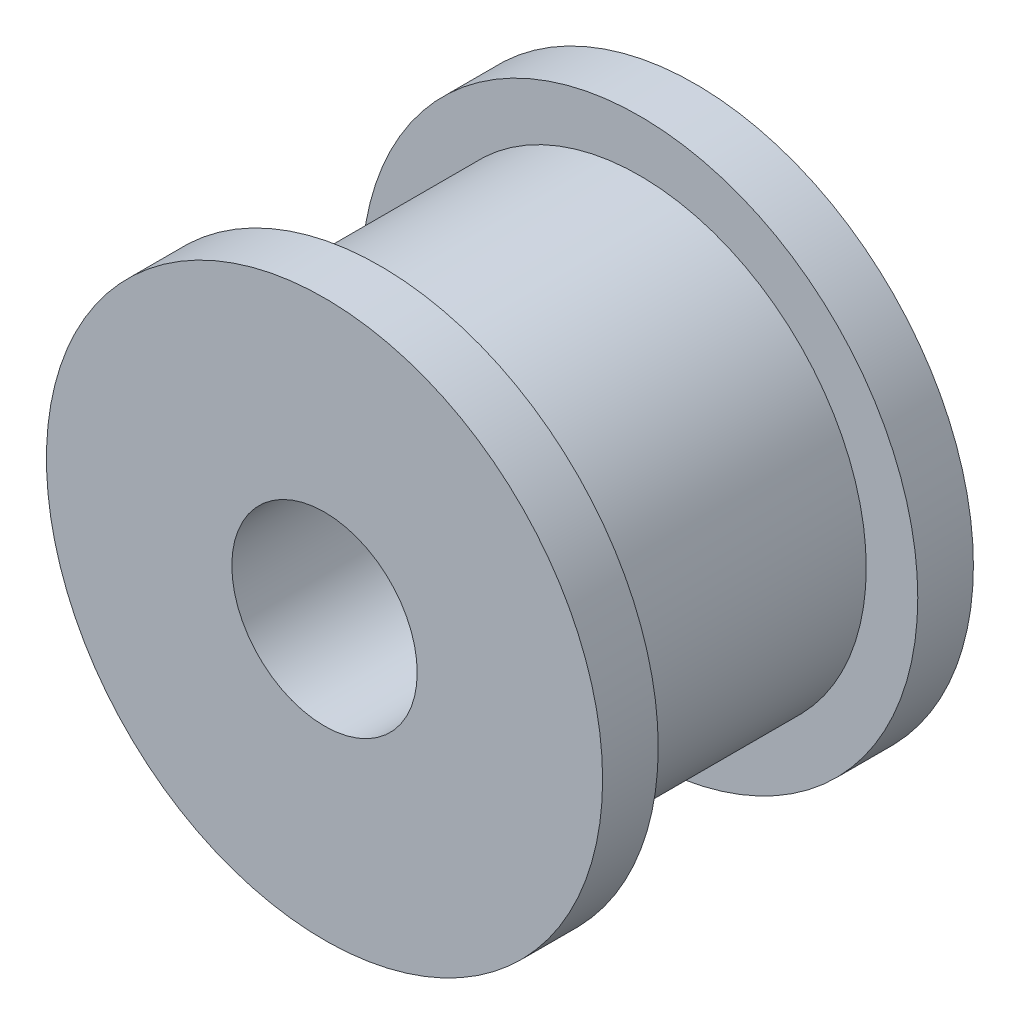
ISO-10303-21;
HEADER;
FILE_DESCRIPTION(('STEP AP214'),'2;1');
FILE_NAME('part.step','',(''),(''),'','','');
FILE_SCHEMA(('AUTOMOTIVE_DESIGN { 1 0 10303 214 1 1 1 1 }'));
ENDSEC;
DATA;
#1=APPLICATION_CONTEXT('core data for automotive mechanical design processes');
#2=APPLICATION_PROTOCOL_DEFINITION('international standard','automotive_design',2000,#1);
#3=PRODUCT_CONTEXT('',#1,'mechanical');
#4=PRODUCT('Part','Part','',(#3));
#5=PRODUCT_RELATED_PRODUCT_CATEGORY('part','',(#4));
#6=PRODUCT_DEFINITION_FORMATION('','',#4);
#7=PRODUCT_DEFINITION_CONTEXT('part definition',#1,'design');
#8=PRODUCT_DEFINITION('design','',#6,#7);
#9=PRODUCT_DEFINITION_SHAPE('','',#8);
#10=(LENGTH_UNIT() NAMED_UNIT(*) SI_UNIT(.MILLI.,.METRE.));
#11=(NAMED_UNIT(*) PLANE_ANGLE_UNIT() SI_UNIT($,.RADIAN.));
#12=(NAMED_UNIT(*) SI_UNIT($,.STERADIAN.) SOLID_ANGLE_UNIT());
#13=UNCERTAINTY_MEASURE_WITH_UNIT(LENGTH_MEASURE(1.E-05),#10,'distance_accuracy_value','');
#14=(GEOMETRIC_REPRESENTATION_CONTEXT(3) GLOBAL_UNCERTAINTY_ASSIGNED_CONTEXT((#13)) GLOBAL_UNIT_ASSIGNED_CONTEXT((#10,
#11,#12)) REPRESENTATION_CONTEXT('',''));
#15=CARTESIAN_POINT('',(0.,0.,0.));
#16=DIRECTION('',(0.,0.,1.));
#17=DIRECTION('',(1.,0.,0.));
#18=AXIS2_PLACEMENT_3D('',#15,#16,#17);
#19=CARTESIAN_POINT('',(0.,0.,-10.));
#20=DIRECTION('',(0.,0.,-1.));
#21=DIRECTION('',(-1.,0.,0.));
#22=AXIS2_PLACEMENT_3D('',#19,#20,#21);
#23=PLANE('',#22);
#24=CARTESIAN_POINT('',(0.,0.,-10.));
#25=DIRECTION('',(0.,0.,-1.));
#26=DIRECTION('',(-1.,0.,0.));
#27=AXIS2_PLACEMENT_3D('',#24,#25,#26);
#28=CIRCLE('',#27,2.49999999999999);
#29=CARTESIAN_POINT('',(-2.49999999999999,0.,-10.));
#30=VERTEX_POINT('',#29);
#31=EDGE_CURVE('E59',#30,#30,#28,.T.);
#32=ORIENTED_EDGE('',*,*,#31,.F.);
#33=EDGE_LOOP('',(#32));
#34=FACE_BOUND('',#33,.T.);
#35=CARTESIAN_POINT('',(0.,0.,-10.));
#36=DIRECTION('',(0.,0.,1.));
#37=DIRECTION('',(1.,0.,0.));
#38=AXIS2_PLACEMENT_3D('',#35,#36,#37);
#39=CIRCLE('',#38,7.5);
#40=CARTESIAN_POINT('',(7.5,0.,-10.));
#41=VERTEX_POINT('',#40);
#42=EDGE_CURVE('E10',#41,#41,#39,.T.);
#43=ORIENTED_EDGE('',*,*,#42,.F.);
#44=EDGE_LOOP('',(#43));
#45=FACE_BOUND('',#44,.T.);
#46=ADVANCED_FACE('F31',(#34,#45),#23,.T.);
#47=CARTESIAN_POINT('',(0.,0.,0.));
#48=DIRECTION('',(0.,0.,1.));
#49=DIRECTION('',(1.,0.,0.));
#50=AXIS2_PLACEMENT_3D('',#47,#48,#49);
#51=CYLINDRICAL_SURFACE('',#50,7.5);
#52=ORIENTED_EDGE('',*,*,#42,.T.);
#53=EDGE_LOOP('',(#52));
#54=FACE_BOUND('',#53,.T.);
#55=CARTESIAN_POINT('',(0.,0.,-8.5));
#56=DIRECTION('',(0.,0.,1.));
#57=DIRECTION('',(1.,0.,0.));
#58=AXIS2_PLACEMENT_3D('',#55,#56,#57);
#59=CIRCLE('',#58,7.5);
#60=CARTESIAN_POINT('',(7.5,0.,-8.5));
#61=VERTEX_POINT('',#60);
#62=EDGE_CURVE('E37',#61,#61,#59,.T.);
#63=ORIENTED_EDGE('',*,*,#62,.F.);
#64=EDGE_LOOP('',(#63));
#65=FACE_BOUND('',#64,.T.);
#66=ADVANCED_FACE('F67',(#54,#65),#51,.T.);
#67=CARTESIAN_POINT('',(7.5,0.,-8.5));
#68=DIRECTION('',(0.,0.,1.));
#69=DIRECTION('',(1.,0.,0.));
#70=AXIS2_PLACEMENT_3D('',#67,#68,#69);
#71=PLANE('',#70);
#72=ORIENTED_EDGE('',*,*,#62,.T.);
#73=EDGE_LOOP('',(#72));
#74=FACE_BOUND('',#73,.T.);
#75=CARTESIAN_POINT('',(0.,0.,-8.5));
#76=DIRECTION('',(0.,0.,1.));
#77=DIRECTION('',(1.,0.,0.));
#78=AXIS2_PLACEMENT_3D('',#75,#76,#77);
#79=CIRCLE('',#78,6.11);
#80=CARTESIAN_POINT('',(6.11,0.,-8.5));
#81=VERTEX_POINT('',#80);
#82=EDGE_CURVE('E41',#81,#81,#79,.T.);
#83=ORIENTED_EDGE('',*,*,#82,.F.);
#84=EDGE_LOOP('',(#83));
#85=FACE_BOUND('',#84,.T.);
#86=ADVANCED_FACE('F71',(#74,#85),#71,.T.);
#87=CARTESIAN_POINT('',(0.,0.,0.));
#88=DIRECTION('',(0.,0.,1.));
#89=DIRECTION('',(1.,0.,0.));
#90=AXIS2_PLACEMENT_3D('',#87,#88,#89);
#91=CYLINDRICAL_SURFACE('',#90,6.11);
#92=ORIENTED_EDGE('',*,*,#82,.T.);
#93=EDGE_LOOP('',(#92));
#94=FACE_BOUND('',#93,.T.);
#95=CARTESIAN_POINT('',(0.,0.,-1.5));
#96=DIRECTION('',(0.,0.,1.));
#97=DIRECTION('',(1.,0.,0.));
#98=AXIS2_PLACEMENT_3D('',#95,#96,#97);
#99=CIRCLE('',#98,6.11);
#100=CARTESIAN_POINT('',(6.11,0.,-1.5));
#101=VERTEX_POINT('',#100);
#102=EDGE_CURVE('E45',#101,#101,#99,.T.);
#103=ORIENTED_EDGE('',*,*,#102,.F.);
#104=EDGE_LOOP('',(#103));
#105=FACE_BOUND('',#104,.T.);
#106=ADVANCED_FACE('F75',(#94,#105),#91,.T.);
#107=CARTESIAN_POINT('',(6.11,0.,-1.5));
#108=DIRECTION('',(0.,0.,-1.));
#109=DIRECTION('',(-1.,0.,0.));
#110=AXIS2_PLACEMENT_3D('',#107,#108,#109);
#111=PLANE('',#110);
#112=ORIENTED_EDGE('',*,*,#102,.T.);
#113=EDGE_LOOP('',(#112));
#114=FACE_BOUND('',#113,.T.);
#115=CARTESIAN_POINT('',(0.,0.,-1.5));
#116=DIRECTION('',(0.,0.,1.));
#117=DIRECTION('',(1.,0.,0.));
#118=AXIS2_PLACEMENT_3D('',#115,#116,#117);
#119=CIRCLE('',#118,7.5);
#120=CARTESIAN_POINT('',(7.5,0.,-1.5));
#121=VERTEX_POINT('',#120);
#122=EDGE_CURVE('E50',#121,#121,#119,.T.);
#123=ORIENTED_EDGE('',*,*,#122,.F.);
#124=EDGE_LOOP('',(#123));
#125=FACE_BOUND('',#124,.T.);
#126=ADVANCED_FACE('F81',(#114,#125),#111,.T.);
#127=CARTESIAN_POINT('',(0.,0.,0.));
#128=DIRECTION('',(0.,0.,1.));
#129=DIRECTION('',(1.,0.,0.));
#130=AXIS2_PLACEMENT_3D('',#127,#128,#129);
#131=CYLINDRICAL_SURFACE('',#130,7.5);
#132=ORIENTED_EDGE('',*,*,#122,.T.);
#133=EDGE_LOOP('',(#132));
#134=FACE_BOUND('',#133,.T.);
#135=CARTESIAN_POINT('',(0.,0.,0.));
#136=DIRECTION('',(0.,0.,1.));
#137=DIRECTION('',(1.,0.,0.));
#138=AXIS2_PLACEMENT_3D('',#135,#136,#137);
#139=CIRCLE('',#138,7.5);
#140=CARTESIAN_POINT('',(7.5,0.,0.));
#141=VERTEX_POINT('',#140);
#142=EDGE_CURVE('E53',#141,#141,#139,.T.);
#143=ORIENTED_EDGE('',*,*,#142,.F.);
#144=EDGE_LOOP('',(#143));
#145=FACE_BOUND('',#144,.T.);
#146=ADVANCED_FACE('F85',(#134,#145),#131,.T.);
#147=CARTESIAN_POINT('',(7.5,0.,0.));
#148=DIRECTION('',(0.,0.,1.));
#149=DIRECTION('',(1.,0.,0.));
#150=AXIS2_PLACEMENT_3D('',#147,#148,#149);
#151=PLANE('',#150);
#152=CARTESIAN_POINT('',(0.,0.,0.));
#153=DIRECTION('',(0.,0.,-1.));
#154=DIRECTION('',(-1.,0.,0.));
#155=AXIS2_PLACEMENT_3D('',#152,#153,#154);
#156=CIRCLE('',#155,2.5);
#157=CARTESIAN_POINT('',(-2.5,0.,0.));
#158=VERTEX_POINT('',#157);
#159=EDGE_CURVE('E56',#158,#158,#156,.T.);
#160=ORIENTED_EDGE('',*,*,#159,.T.);
#161=EDGE_LOOP('',(#160));
#162=FACE_BOUND('',#161,.T.);
#163=ORIENTED_EDGE('',*,*,#142,.T.);
#164=EDGE_LOOP('',(#163));
#165=FACE_BOUND('',#164,.T.);
#166=ADVANCED_FACE('F89',(#162,#165),#151,.T.);
#167=CARTESIAN_POINT('',(0.,0.,-10.));
#168=DIRECTION('',(0.,0.,-1.));
#169=DIRECTION('',(-1.,0.,0.));
#170=AXIS2_PLACEMENT_3D('',#167,#168,#169);
#171=CYLINDRICAL_SURFACE('',#170,2.49999999999999);
#172=ORIENTED_EDGE('',*,*,#159,.F.);
#173=EDGE_LOOP('',(#172));
#174=FACE_BOUND('',#173,.T.);
#175=ORIENTED_EDGE('',*,*,#31,.T.);
#176=EDGE_LOOP('',(#175));
#177=FACE_BOUND('',#176,.T.);
#178=ADVANCED_FACE('F63',(#174,#177),#171,.F.);
#179=CLOSED_SHELL('',(#46,#66,#86,#106,#126,#146,#166,#178));
#180=MANIFOLD_SOLID_BREP('B2',#179);
#181=ADVANCED_BREP_SHAPE_REPRESENTATION('',(#18,#180),#14);
#182=SHAPE_DEFINITION_REPRESENTATION(#9,#181);
ENDSEC;
END-ISO-10303-21;
